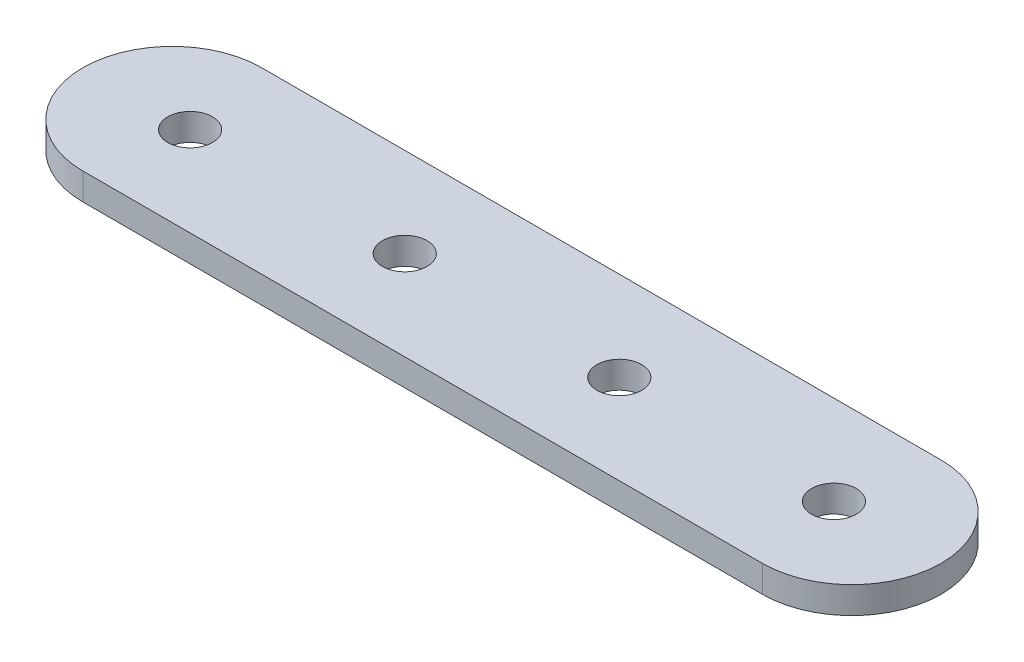
ISO-10303-21;
HEADER;
FILE_DESCRIPTION(('STEP AP214'),'2;1');
FILE_NAME('part.step','',(''),(''),'','','');
FILE_SCHEMA(('AUTOMOTIVE_DESIGN { 1 0 10303 214 1 1 1 1 }'));
ENDSEC;
DATA;
#1=APPLICATION_CONTEXT('core data for automotive mechanical design processes');
#2=APPLICATION_PROTOCOL_DEFINITION('international standard','automotive_design',2000,#1);
#3=PRODUCT_CONTEXT('',#1,'mechanical');
#4=PRODUCT('Part','Part','',(#3));
#5=PRODUCT_RELATED_PRODUCT_CATEGORY('part','',(#4));
#6=PRODUCT_DEFINITION_FORMATION('','',#4);
#7=PRODUCT_DEFINITION_CONTEXT('part definition',#1,'design');
#8=PRODUCT_DEFINITION('design','',#6,#7);
#9=PRODUCT_DEFINITION_SHAPE('','',#8);
#10=(LENGTH_UNIT() NAMED_UNIT(*) SI_UNIT(.MILLI.,.METRE.));
#11=(NAMED_UNIT(*) PLANE_ANGLE_UNIT() SI_UNIT($,.RADIAN.));
#12=(NAMED_UNIT(*) SI_UNIT($,.STERADIAN.) SOLID_ANGLE_UNIT());
#13=UNCERTAINTY_MEASURE_WITH_UNIT(LENGTH_MEASURE(1.E-05),#10,'distance_accuracy_value','');
#14=(GEOMETRIC_REPRESENTATION_CONTEXT(3) GLOBAL_UNCERTAINTY_ASSIGNED_CONTEXT((#13)) GLOBAL_UNIT_ASSIGNED_CONTEXT((#10,
#11,#12)) REPRESENTATION_CONTEXT('',''));
#15=CARTESIAN_POINT('',(0.,0.,0.));
#16=DIRECTION('',(0.,0.,1.));
#17=DIRECTION('',(1.,0.,0.));
#18=AXIS2_PLACEMENT_3D('',#15,#16,#17);
#19=CARTESIAN_POINT('',(86.,3.,-10.));
#20=DIRECTION('',(0.,1.,0.));
#21=DIRECTION('',(0.,0.,1.));
#22=AXIS2_PLACEMENT_3D('',#19,#20,#21);
#23=PLANE('',#22);
#24=CARTESIAN_POINT('',(60.,3.,-10.));
#25=DIRECTION('',(0.,1.,0.));
#26=DIRECTION('',(0.,0.,1.));
#27=AXIS2_PLACEMENT_3D('',#24,#25,#26);
#28=CIRCLE('',#27,2.49999999999999);
#29=CARTESIAN_POINT('',(60.,3.,-7.5));
#30=VERTEX_POINT('',#29);
#31=EDGE_CURVE('E142',#30,#30,#28,.T.);
#32=ORIENTED_EDGE('',*,*,#31,.F.);
#33=EDGE_LOOP('',(#32));
#34=FACE_BOUND('',#33,.T.);
#35=CARTESIAN_POINT('',(12.,3.,-10.));
#36=DIRECTION('',(0.,1.,0.));
#37=DIRECTION('',(0.,0.,1.));
#38=AXIS2_PLACEMENT_3D('',#35,#36,#37);
#39=CIRCLE('',#38,2.5);
#40=CARTESIAN_POINT('',(12.,3.,-7.5));
#41=VERTEX_POINT('',#40);
#42=EDGE_CURVE('E112',#41,#41,#39,.T.);
#43=ORIENTED_EDGE('',*,*,#42,.F.);
#44=EDGE_LOOP('',(#43));
#45=FACE_BOUND('',#44,.T.);
#46=CARTESIAN_POINT('',(86.,3.,-10.));
#47=DIRECTION('',(0.,1.,0.));
#48=DIRECTION('',(0.,0.,1.));
#49=AXIS2_PLACEMENT_3D('',#46,#47,#48);
#50=CIRCLE('',#49,10.);
#51=CARTESIAN_POINT('',(86.,3.,0.));
#52=VERTEX_POINT('',#51);
#53=CARTESIAN_POINT('',(86.,3.,-20.));
#54=VERTEX_POINT('',#53);
#55=EDGE_CURVE('E92',#52,#54,#50,.T.);
#56=ORIENTED_EDGE('',*,*,#55,.T.);
#57=DIRECTION('',(-1.,0.,0.));
#58=VECTOR('',#57,1.);
#59=CARTESIAN_POINT('',(86.,3.,-20.));
#60=LINE('',#59,#58);
#61=CARTESIAN_POINT('',(10.,3.,-20.));
#62=VERTEX_POINT('',#61);
#63=EDGE_CURVE('E87',#54,#62,#60,.T.);
#64=ORIENTED_EDGE('',*,*,#63,.T.);
#65=CARTESIAN_POINT('',(10.,3.,-10.));
#66=DIRECTION('',(0.,1.,0.));
#67=DIRECTION('',(0.,0.,1.));
#68=AXIS2_PLACEMENT_3D('',#65,#66,#67);
#69=CIRCLE('',#68,10.);
#70=CARTESIAN_POINT('',(10.,3.,0.));
#71=VERTEX_POINT('',#70);
#72=EDGE_CURVE('E90',#62,#71,#69,.T.);
#73=ORIENTED_EDGE('',*,*,#72,.T.);
#74=DIRECTION('',(1.,0.,0.));
#75=VECTOR('',#74,1.);
#76=CARTESIAN_POINT('',(10.,3.,0.));
#77=LINE('',#76,#75);
#78=EDGE_CURVE('E57',#71,#52,#77,.T.);
#79=ORIENTED_EDGE('',*,*,#78,.T.);
#80=EDGE_LOOP('',(#56,#64,#73,#79));
#81=FACE_BOUND('',#80,.T.);
#82=CARTESIAN_POINT('',(36.,3.,-10.));
#83=DIRECTION('',(0.,1.,0.));
#84=DIRECTION('',(0.,0.,1.));
#85=AXIS2_PLACEMENT_3D('',#82,#83,#84);
#86=CIRCLE('',#85,2.5);
#87=CARTESIAN_POINT('',(36.,3.,-7.5));
#88=VERTEX_POINT('',#87);
#89=EDGE_CURVE('E134',#88,#88,#86,.T.);
#90=ORIENTED_EDGE('',*,*,#89,.F.);
#91=EDGE_LOOP('',(#90));
#92=FACE_BOUND('',#91,.T.);
#93=CARTESIAN_POINT('',(84.,3.,-10.));
#94=DIRECTION('',(0.,1.,0.));
#95=DIRECTION('',(0.,0.,1.));
#96=AXIS2_PLACEMENT_3D('',#93,#94,#95);
#97=CIRCLE('',#96,2.5);
#98=CARTESIAN_POINT('',(84.,3.,-7.5));
#99=VERTEX_POINT('',#98);
#100=EDGE_CURVE('E150',#99,#99,#97,.T.);
#101=ORIENTED_EDGE('',*,*,#100,.F.);
#102=EDGE_LOOP('',(#101));
#103=FACE_BOUND('',#102,.T.);
#104=ADVANCED_FACE('F39',(#34,#45,#81,#92,#103),#23,.T.);
#105=CARTESIAN_POINT('',(86.,0.,-10.));
#106=DIRECTION('',(0.,1.,0.));
#107=DIRECTION('',(0.,0.,1.));
#108=AXIS2_PLACEMENT_3D('',#105,#106,#107);
#109=PLANE('',#108);
#110=CARTESIAN_POINT('',(86.,0.,-10.));
#111=DIRECTION('',(0.,1.,0.));
#112=DIRECTION('',(0.,0.,1.));
#113=AXIS2_PLACEMENT_3D('',#110,#111,#112);
#114=CIRCLE('',#113,10.);
#115=CARTESIAN_POINT('',(86.,0.,0.));
#116=VERTEX_POINT('',#115);
#117=CARTESIAN_POINT('',(86.,0.,-20.));
#118=VERTEX_POINT('',#117);
#119=EDGE_CURVE('E108',#116,#118,#114,.T.);
#120=ORIENTED_EDGE('',*,*,#119,.F.);
#121=DIRECTION('',(1.,0.,0.));
#122=VECTOR('',#121,1.);
#123=CARTESIAN_POINT('',(10.,0.,0.));
#124=LINE('',#123,#122);
#125=CARTESIAN_POINT('',(10.,0.,0.));
#126=VERTEX_POINT('',#125);
#127=EDGE_CURVE('E80',#126,#116,#124,.T.);
#128=ORIENTED_EDGE('',*,*,#127,.F.);
#129=CARTESIAN_POINT('',(10.,0.,-10.));
#130=DIRECTION('',(0.,1.,0.));
#131=DIRECTION('',(0.,0.,1.));
#132=AXIS2_PLACEMENT_3D('',#129,#130,#131);
#133=CIRCLE('',#132,10.);
#134=CARTESIAN_POINT('',(10.,0.,-20.));
#135=VERTEX_POINT('',#134);
#136=EDGE_CURVE('E74',#135,#126,#133,.T.);
#137=ORIENTED_EDGE('',*,*,#136,.F.);
#138=DIRECTION('',(-1.,0.,0.));
#139=VECTOR('',#138,1.);
#140=CARTESIAN_POINT('',(86.,0.,-20.));
#141=LINE('',#140,#139);
#142=EDGE_CURVE('E97',#118,#135,#141,.T.);
#143=ORIENTED_EDGE('',*,*,#142,.F.);
#144=EDGE_LOOP('',(#120,#128,#137,#143));
#145=FACE_BOUND('',#144,.T.);
#146=CARTESIAN_POINT('',(12.,0.,-10.));
#147=DIRECTION('',(0.,1.,0.));
#148=DIRECTION('',(0.,0.,1.));
#149=AXIS2_PLACEMENT_3D('',#146,#147,#148);
#150=CIRCLE('',#149,2.5);
#151=CARTESIAN_POINT('',(12.,0.,-7.5));
#152=VERTEX_POINT('',#151);
#153=EDGE_CURVE('E130',#152,#152,#150,.T.);
#154=ORIENTED_EDGE('',*,*,#153,.T.);
#155=EDGE_LOOP('',(#154));
#156=FACE_BOUND('',#155,.T.);
#157=CARTESIAN_POINT('',(36.,0.,-10.));
#158=DIRECTION('',(0.,1.,0.));
#159=DIRECTION('',(0.,0.,1.));
#160=AXIS2_PLACEMENT_3D('',#157,#158,#159);
#161=CIRCLE('',#160,2.5);
#162=CARTESIAN_POINT('',(36.,0.,-7.5));
#163=VERTEX_POINT('',#162);
#164=EDGE_CURVE('E138',#163,#163,#161,.T.);
#165=ORIENTED_EDGE('',*,*,#164,.T.);
#166=EDGE_LOOP('',(#165));
#167=FACE_BOUND('',#166,.T.);
#168=CARTESIAN_POINT('',(60.,0.,-10.));
#169=DIRECTION('',(0.,1.,0.));
#170=DIRECTION('',(0.,0.,1.));
#171=AXIS2_PLACEMENT_3D('',#168,#169,#170);
#172=CIRCLE('',#171,2.49999999999999);
#173=CARTESIAN_POINT('',(60.,0.,-7.5));
#174=VERTEX_POINT('',#173);
#175=EDGE_CURVE('E146',#174,#174,#172,.T.);
#176=ORIENTED_EDGE('',*,*,#175,.T.);
#177=EDGE_LOOP('',(#176));
#178=FACE_BOUND('',#177,.T.);
#179=CARTESIAN_POINT('',(84.,0.,-10.));
#180=DIRECTION('',(0.,1.,0.));
#181=DIRECTION('',(0.,0.,1.));
#182=AXIS2_PLACEMENT_3D('',#179,#180,#181);
#183=CIRCLE('',#182,2.5);
#184=CARTESIAN_POINT('',(84.,0.,-7.5));
#185=VERTEX_POINT('',#184);
#186=EDGE_CURVE('E154',#185,#185,#183,.T.);
#187=ORIENTED_EDGE('',*,*,#186,.T.);
#188=EDGE_LOOP('',(#187));
#189=FACE_BOUND('',#188,.T.);
#190=ADVANCED_FACE('F125',(#145,#156,#167,#178,#189),#109,.F.);
#191=CARTESIAN_POINT('',(86.,3.,-10.));
#192=DIRECTION('',(0.,-1.,0.));
#193=DIRECTION('',(0.,0.,-1.));
#194=AXIS2_PLACEMENT_3D('',#191,#192,#193);
#195=CYLINDRICAL_SURFACE('',#194,10.);
#196=ORIENTED_EDGE('',*,*,#119,.T.);
#197=DIRECTION('',(0.,-1.,0.));
#198=VECTOR('',#197,1.);
#199=CARTESIAN_POINT('',(86.,3.,-20.));
#200=LINE('',#199,#198);
#201=EDGE_CURVE('E11',#54,#118,#200,.T.);
#202=ORIENTED_EDGE('',*,*,#201,.F.);
#203=ORIENTED_EDGE('',*,*,#55,.F.);
#204=DIRECTION('',(0.,-1.,0.));
#205=VECTOR('',#204,1.);
#206=CARTESIAN_POINT('',(86.,3.,0.));
#207=LINE('',#206,#205);
#208=EDGE_CURVE('E104',#52,#116,#207,.T.);
#209=ORIENTED_EDGE('',*,*,#208,.T.);
#210=EDGE_LOOP('',(#196,#202,#203,#209));
#211=FACE_BOUND('',#210,.T.);
#212=ADVANCED_FACE('F41',(#211),#195,.T.);
#213=CARTESIAN_POINT('',(86.,3.,-20.));
#214=DIRECTION('',(0.,0.,1.));
#215=DIRECTION('',(1.,0.,0.));
#216=AXIS2_PLACEMENT_3D('',#213,#214,#215);
#217=PLANE('',#216);
#218=ORIENTED_EDGE('',*,*,#142,.T.);
#219=DIRECTION('',(0.,-1.,0.));
#220=VECTOR('',#219,1.);
#221=CARTESIAN_POINT('',(10.,3.,-20.));
#222=LINE('',#221,#220);
#223=EDGE_CURVE('E49',#62,#135,#222,.T.);
#224=ORIENTED_EDGE('',*,*,#223,.F.);
#225=ORIENTED_EDGE('',*,*,#63,.F.);
#226=ORIENTED_EDGE('',*,*,#201,.T.);
#227=EDGE_LOOP('',(#218,#224,#225,#226));
#228=FACE_BOUND('',#227,.T.);
#229=ADVANCED_FACE('F96',(#228),#217,.F.);
#230=CARTESIAN_POINT('',(10.,3.,-10.));
#231=DIRECTION('',(0.,-1.,0.));
#232=DIRECTION('',(0.,0.,-1.));
#233=AXIS2_PLACEMENT_3D('',#230,#231,#232);
#234=CYLINDRICAL_SURFACE('',#233,10.);
#235=ORIENTED_EDGE('',*,*,#136,.T.);
#236=DIRECTION('',(0.,-1.,0.));
#237=VECTOR('',#236,1.);
#238=CARTESIAN_POINT('',(10.,3.,0.));
#239=LINE('',#238,#237);
#240=EDGE_CURVE('E99',#71,#126,#239,.T.);
#241=ORIENTED_EDGE('',*,*,#240,.F.);
#242=ORIENTED_EDGE('',*,*,#72,.F.);
#243=ORIENTED_EDGE('',*,*,#223,.T.);
#244=EDGE_LOOP('',(#235,#241,#242,#243));
#245=FACE_BOUND('',#244,.T.);
#246=ADVANCED_FACE('F100',(#245),#234,.T.);
#247=CARTESIAN_POINT('',(10.,3.,0.));
#248=DIRECTION('',(0.,0.,-1.));
#249=DIRECTION('',(-1.,0.,0.));
#250=AXIS2_PLACEMENT_3D('',#247,#248,#249);
#251=PLANE('',#250);
#252=ORIENTED_EDGE('',*,*,#127,.T.);
#253=ORIENTED_EDGE('',*,*,#208,.F.);
#254=ORIENTED_EDGE('',*,*,#78,.F.);
#255=ORIENTED_EDGE('',*,*,#240,.T.);
#256=EDGE_LOOP('',(#252,#253,#254,#255));
#257=FACE_BOUND('',#256,.T.);
#258=ADVANCED_FACE('F122',(#257),#251,.F.);
#259=CARTESIAN_POINT('',(12.,3.,-10.));
#260=DIRECTION('',(0.,-1.,0.));
#261=DIRECTION('',(0.,0.,-1.));
#262=AXIS2_PLACEMENT_3D('',#259,#260,#261);
#263=CYLINDRICAL_SURFACE('',#262,2.5);
#264=ORIENTED_EDGE('',*,*,#42,.T.);
#265=EDGE_LOOP('',(#264));
#266=FACE_BOUND('',#265,.T.);
#267=ORIENTED_EDGE('',*,*,#153,.F.);
#268=EDGE_LOOP('',(#267));
#269=FACE_BOUND('',#268,.T.);
#270=ADVANCED_FACE('F175',(#266,#269),#263,.F.);
#271=CARTESIAN_POINT('',(36.,3.,-10.));
#272=DIRECTION('',(0.,-1.,0.));
#273=DIRECTION('',(0.,0.,-1.));
#274=AXIS2_PLACEMENT_3D('',#271,#272,#273);
#275=CYLINDRICAL_SURFACE('',#274,2.5);
#276=ORIENTED_EDGE('',*,*,#89,.T.);
#277=EDGE_LOOP('',(#276));
#278=FACE_BOUND('',#277,.T.);
#279=ORIENTED_EDGE('',*,*,#164,.F.);
#280=EDGE_LOOP('',(#279));
#281=FACE_BOUND('',#280,.T.);
#282=ADVANCED_FACE('F221',(#278,#281),#275,.F.);
#283=CARTESIAN_POINT('',(60.,3.,-10.));
#284=DIRECTION('',(0.,-1.,0.));
#285=DIRECTION('',(0.,0.,-1.));
#286=AXIS2_PLACEMENT_3D('',#283,#284,#285);
#287=CYLINDRICAL_SURFACE('',#286,2.49999999999999);
#288=ORIENTED_EDGE('',*,*,#31,.T.);
#289=EDGE_LOOP('',(#288));
#290=FACE_BOUND('',#289,.T.);
#291=ORIENTED_EDGE('',*,*,#175,.F.);
#292=EDGE_LOOP('',(#291));
#293=FACE_BOUND('',#292,.T.);
#294=ADVANCED_FACE('F229',(#290,#293),#287,.F.);
#295=CARTESIAN_POINT('',(84.,3.,-10.));
#296=DIRECTION('',(0.,-1.,0.));
#297=DIRECTION('',(0.,0.,-1.));
#298=AXIS2_PLACEMENT_3D('',#295,#296,#297);
#299=CYLINDRICAL_SURFACE('',#298,2.5);
#300=ORIENTED_EDGE('',*,*,#100,.T.);
#301=EDGE_LOOP('',(#300));
#302=FACE_BOUND('',#301,.T.);
#303=ORIENTED_EDGE('',*,*,#186,.F.);
#304=EDGE_LOOP('',(#303));
#305=FACE_BOUND('',#304,.T.);
#306=ADVANCED_FACE('F162',(#302,#305),#299,.F.);
#307=CLOSED_SHELL('',(#104,#190,#212,#229,#246,#258,#270,#282,#294,#306));
#308=MANIFOLD_SOLID_BREP('B2',#307);
#309=ADVANCED_BREP_SHAPE_REPRESENTATION('',(#18,#308),#14);
#310=SHAPE_DEFINITION_REPRESENTATION(#9,#309);
ENDSEC;
END-ISO-10303-21;
